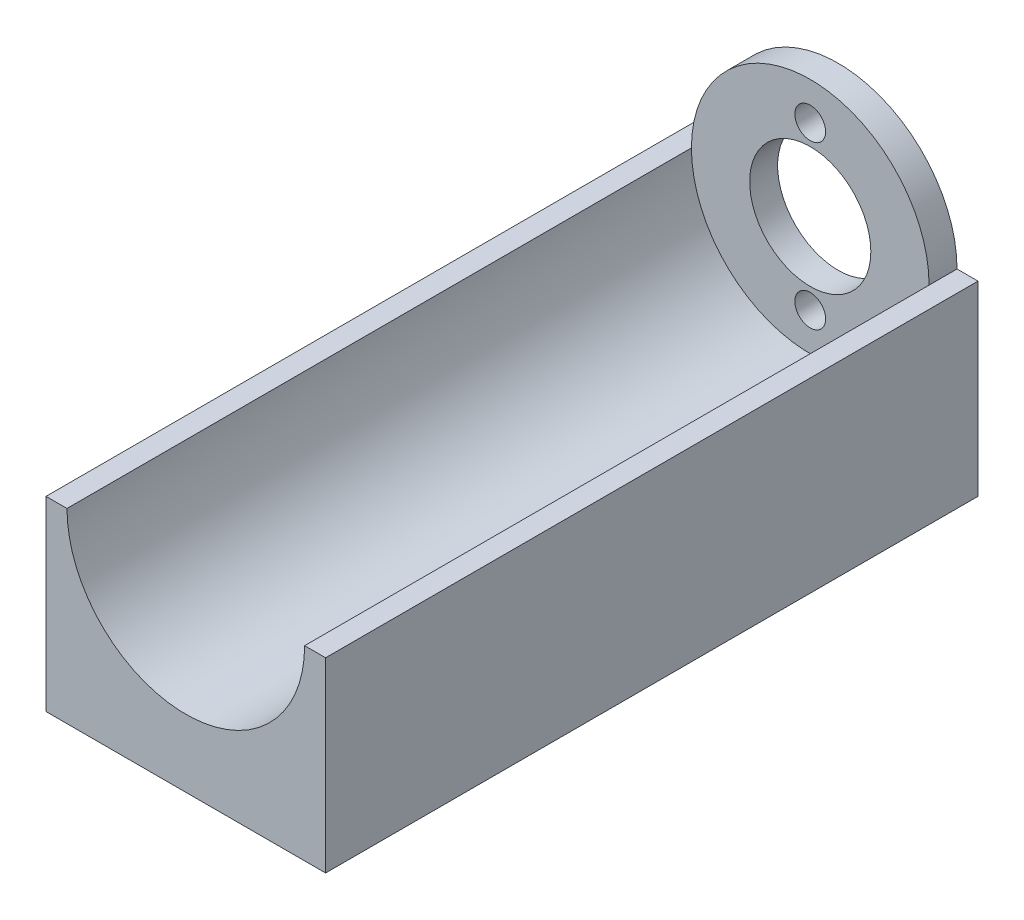
ISO-10303-21;
HEADER;
FILE_DESCRIPTION(('STEP AP214'),'2;1');
FILE_NAME('part.step','',(''),(''),'','','');
FILE_SCHEMA(('AUTOMOTIVE_DESIGN { 1 0 10303 214 1 1 1 1 }'));
ENDSEC;
DATA;
#1=APPLICATION_CONTEXT('core data for automotive mechanical design processes');
#2=APPLICATION_PROTOCOL_DEFINITION('international standard','automotive_design',2000,#1);
#3=PRODUCT_CONTEXT('',#1,'mechanical');
#4=PRODUCT('Part','Part','',(#3));
#5=PRODUCT_RELATED_PRODUCT_CATEGORY('part','',(#4));
#6=PRODUCT_DEFINITION_FORMATION('','',#4);
#7=PRODUCT_DEFINITION_CONTEXT('part definition',#1,'design');
#8=PRODUCT_DEFINITION('design','',#6,#7);
#9=PRODUCT_DEFINITION_SHAPE('','',#8);
#10=(LENGTH_UNIT() NAMED_UNIT(*) SI_UNIT(.MILLI.,.METRE.));
#11=(NAMED_UNIT(*) PLANE_ANGLE_UNIT() SI_UNIT($,.RADIAN.));
#12=(NAMED_UNIT(*) SI_UNIT($,.STERADIAN.) SOLID_ANGLE_UNIT());
#13=UNCERTAINTY_MEASURE_WITH_UNIT(LENGTH_MEASURE(1.E-05),#10,'distance_accuracy_value','');
#14=(GEOMETRIC_REPRESENTATION_CONTEXT(3) GLOBAL_UNCERTAINTY_ASSIGNED_CONTEXT((#13)) GLOBAL_UNIT_ASSIGNED_CONTEXT((#10,
#11,#12)) REPRESENTATION_CONTEXT('',''));
#15=CARTESIAN_POINT('',(0.,0.,0.));
#16=DIRECTION('',(0.,0.,1.));
#17=DIRECTION('',(1.,0.,0.));
#18=AXIS2_PLACEMENT_3D('',#15,#16,#17);
#19=CARTESIAN_POINT('',(0.,0.,3.));
#20=DIRECTION('',(0.,0.,-1.));
#21=DIRECTION('',(-1.,0.,0.));
#22=AXIS2_PLACEMENT_3D('',#19,#20,#21);
#23=CYLINDRICAL_SURFACE('',#22,12.75);
#24=DIRECTION('',(0.,0.,1.));
#25=VECTOR('',#24,1.);
#26=CARTESIAN_POINT('',(-12.75,0.,-36.0555127546399));
#27=LINE('',#26,#25);
#28=CARTESIAN_POINT('',(-12.75,0.,0.));
#29=VERTEX_POINT('',#28);
#30=CARTESIAN_POINT('',(-12.75,0.,3.));
#31=VERTEX_POINT('',#30);
#32=EDGE_CURVE('E62',#29,#31,#27,.T.);
#33=ORIENTED_EDGE('',*,*,#32,.T.);
#34=CARTESIAN_POINT('',(0.,0.,3.));
#35=DIRECTION('',(0.,0.,1.));
#36=DIRECTION('',(1.,0.,0.));
#37=AXIS2_PLACEMENT_3D('',#34,#35,#36);
#38=CIRCLE('',#37,12.75);
#39=CARTESIAN_POINT('',(12.75,0.,3.));
#40=VERTEX_POINT('',#39);
#41=EDGE_CURVE('E11',#40,#31,#38,.T.);
#42=ORIENTED_EDGE('',*,*,#41,.F.);
#43=DIRECTION('',(0.,0.,1.));
#44=VECTOR('',#43,1.);
#45=CARTESIAN_POINT('',(12.75,0.,-36.0555127546399));
#46=LINE('',#45,#44);
#47=CARTESIAN_POINT('',(12.75,0.,0.));
#48=VERTEX_POINT('',#47);
#49=EDGE_CURVE('E161',#48,#40,#46,.T.);
#50=ORIENTED_EDGE('',*,*,#49,.F.);
#51=CARTESIAN_POINT('',(0.,0.,0.));
#52=DIRECTION('',(0.,0.,1.));
#53=DIRECTION('',(1.,0.,0.));
#54=AXIS2_PLACEMENT_3D('',#51,#52,#53);
#55=CIRCLE('',#54,12.75);
#56=EDGE_CURVE('E46',#48,#29,#55,.T.);
#57=ORIENTED_EDGE('',*,*,#56,.T.);
#58=EDGE_LOOP('',(#33,#42,#50,#57));
#59=FACE_BOUND('',#58,.T.);
#60=ADVANCED_FACE('F43',(#59),#23,.T.);
#61=CARTESIAN_POINT('',(0.,0.,3.));
#62=DIRECTION('',(0.,0.,1.));
#63=DIRECTION('',(1.,0.,0.));
#64=AXIS2_PLACEMENT_3D('',#61,#62,#63);
#65=PLANE('',#64);
#66=CARTESIAN_POINT('',(0.,8.7,3.));
#67=DIRECTION('',(0.,0.,1.));
#68=DIRECTION('',(1.,0.,0.));
#69=AXIS2_PLACEMENT_3D('',#66,#67,#68);
#70=CIRCLE('',#69,1.65);
#71=CARTESIAN_POINT('',(1.65,8.7,3.));
#72=VERTEX_POINT('',#71);
#73=EDGE_CURVE('E196',#72,#72,#70,.T.);
#74=ORIENTED_EDGE('',*,*,#73,.F.);
#75=EDGE_LOOP('',(#74));
#76=FACE_BOUND('',#75,.T.);
#77=CARTESIAN_POINT('',(0.,-8.7,3.));
#78=DIRECTION('',(0.,0.,1.));
#79=DIRECTION('',(1.,0.,0.));
#80=AXIS2_PLACEMENT_3D('',#77,#78,#79);
#81=CIRCLE('',#80,1.65);
#82=CARTESIAN_POINT('',(1.65,-8.7,3.));
#83=VERTEX_POINT('',#82);
#84=EDGE_CURVE('E200',#83,#83,#81,.T.);
#85=ORIENTED_EDGE('',*,*,#84,.F.);
#86=EDGE_LOOP('',(#85));
#87=FACE_BOUND('',#86,.T.);
#88=ORIENTED_EDGE('',*,*,#41,.T.);
#89=EDGE_CURVE('E51',#31,#40,#38,.T.);
#90=ORIENTED_EDGE('',*,*,#89,.T.);
#91=EDGE_LOOP('',(#88,#90));
#92=FACE_BOUND('',#91,.T.);
#93=CARTESIAN_POINT('',(0.,0.,3.));
#94=DIRECTION('',(0.,0.,1.));
#95=DIRECTION('',(1.,0.,0.));
#96=AXIS2_PLACEMENT_3D('',#93,#94,#95);
#97=CIRCLE('',#96,6.5);
#98=CARTESIAN_POINT('',(6.5,0.,3.));
#99=VERTEX_POINT('',#98);
#100=EDGE_CURVE('E165',#99,#99,#97,.T.);
#101=ORIENTED_EDGE('',*,*,#100,.F.);
#102=EDGE_LOOP('',(#101));
#103=FACE_BOUND('',#102,.T.);
#104=ADVANCED_FACE('F183',(#76,#87,#92,#103),#65,.T.);
#105=CARTESIAN_POINT('',(0.,0.,0.));
#106=DIRECTION('',(0.,0.,1.));
#107=DIRECTION('',(1.,0.,0.));
#108=AXIS2_PLACEMENT_3D('',#105,#106,#107);
#109=PLANE('',#108);
#110=CARTESIAN_POINT('',(0.,8.7,0.));
#111=DIRECTION('',(0.,0.,-1.));
#112=DIRECTION('',(-1.,0.,0.));
#113=AXIS2_PLACEMENT_3D('',#110,#111,#112);
#114=CIRCLE('',#113,1.65);
#115=CARTESIAN_POINT('',(-1.65,8.7,0.));
#116=VERTEX_POINT('',#115);
#117=EDGE_CURVE('E366',#116,#116,#114,.T.);
#118=ORIENTED_EDGE('',*,*,#117,.F.);
#119=EDGE_LOOP('',(#118));
#120=FACE_BOUND('',#119,.T.);
#121=CARTESIAN_POINT('',(0.,-8.7,0.));
#122=DIRECTION('',(0.,0.,-1.));
#123=DIRECTION('',(1.,0.,0.));
#124=AXIS2_PLACEMENT_3D('',#121,#122,#123);
#125=CIRCLE('',#124,1.65);
#126=CARTESIAN_POINT('',(1.65,-8.7,0.));
#127=VERTEX_POINT('',#126);
#128=EDGE_CURVE('E367',#127,#127,#125,.T.);
#129=ORIENTED_EDGE('',*,*,#128,.F.);
#130=EDGE_LOOP('',(#129));
#131=FACE_BOUND('',#130,.T.);
#132=ORIENTED_EDGE('',*,*,#56,.F.);
#133=DIRECTION('',(1.,0.,0.));
#134=VECTOR('',#133,1.);
#135=CARTESIAN_POINT('',(0.,0.,0.));
#136=LINE('',#135,#134);
#137=CARTESIAN_POINT('',(15.,0.,0.));
#138=VERTEX_POINT('',#137);
#139=EDGE_CURVE('E153',#48,#138,#136,.T.);
#140=ORIENTED_EDGE('',*,*,#139,.T.);
#141=DIRECTION('',(0.,1.,0.));
#142=VECTOR('',#141,1.);
#143=CARTESIAN_POINT('',(15.,0.,0.));
#144=LINE('',#143,#142);
#145=CARTESIAN_POINT('',(15.,-20.,0.));
#146=VERTEX_POINT('',#145);
#147=EDGE_CURVE('E108',#146,#138,#144,.T.);
#148=ORIENTED_EDGE('',*,*,#147,.F.);
#149=DIRECTION('',(1.,0.,0.));
#150=VECTOR('',#149,1.);
#151=CARTESIAN_POINT('',(0.,-20.,0.));
#152=LINE('',#151,#150);
#153=CARTESIAN_POINT('',(-15.,-20.,0.));
#154=VERTEX_POINT('',#153);
#155=EDGE_CURVE('E149',#154,#146,#152,.T.);
#156=ORIENTED_EDGE('',*,*,#155,.F.);
#157=DIRECTION('',(0.,-1.,0.));
#158=VECTOR('',#157,1.);
#159=CARTESIAN_POINT('',(-15.,0.,0.));
#160=LINE('',#159,#158);
#161=CARTESIAN_POINT('',(-15.,0.,0.));
#162=VERTEX_POINT('',#161);
#163=EDGE_CURVE('E145',#162,#154,#160,.T.);
#164=ORIENTED_EDGE('',*,*,#163,.F.);
#165=DIRECTION('',(-1.,0.,0.));
#166=VECTOR('',#165,1.);
#167=CARTESIAN_POINT('',(0.,0.,0.));
#168=LINE('',#167,#166);
#169=EDGE_CURVE('E142',#29,#162,#168,.T.);
#170=ORIENTED_EDGE('',*,*,#169,.F.);
#171=EDGE_LOOP('',(#132,#140,#148,#156,#164,#170));
#172=FACE_BOUND('',#171,.T.);
#173=CARTESIAN_POINT('',(0.,0.,0.));
#174=DIRECTION('',(0.,0.,1.));
#175=DIRECTION('',(1.,0.,0.));
#176=AXIS2_PLACEMENT_3D('',#173,#174,#175);
#177=CIRCLE('',#176,6.5);
#178=CARTESIAN_POINT('',(6.5,0.,0.));
#179=VERTEX_POINT('',#178);
#180=EDGE_CURVE('E164',#179,#179,#177,.T.);
#181=ORIENTED_EDGE('',*,*,#180,.T.);
#182=EDGE_LOOP('',(#181));
#183=FACE_BOUND('',#182,.T.);
#184=ADVANCED_FACE('F171',(#120,#131,#172,#183),#109,.F.);
#185=CARTESIAN_POINT('',(0.,0.,3.));
#186=DIRECTION('',(0.,0.,-1.));
#187=DIRECTION('',(-1.,0.,0.));
#188=AXIS2_PLACEMENT_3D('',#185,#186,#187);
#189=CYLINDRICAL_SURFACE('',#188,6.5);
#190=ORIENTED_EDGE('',*,*,#100,.T.);
#191=EDGE_LOOP('',(#190));
#192=FACE_BOUND('',#191,.T.);
#193=ORIENTED_EDGE('',*,*,#180,.F.);
#194=EDGE_LOOP('',(#193));
#195=FACE_BOUND('',#194,.T.);
#196=ADVANCED_FACE('F173',(#192,#195),#189,.F.);
#197=CARTESIAN_POINT('',(15.,0.,-36.0555127546399));
#198=DIRECTION('',(-1.,0.,0.));
#199=DIRECTION('',(0.,0.,1.));
#200=AXIS2_PLACEMENT_3D('',#197,#198,#199);
#201=PLANE('',#200);
#202=DIRECTION('',(0.,0.,1.));
#203=VECTOR('',#202,1.);
#204=CARTESIAN_POINT('',(15.,-20.,-36.0555127546399));
#205=LINE('',#204,#203);
#206=CARTESIAN_POINT('',(15.,-20.,70.));
#207=VERTEX_POINT('',#206);
#208=EDGE_CURVE('E146',#146,#207,#205,.T.);
#209=ORIENTED_EDGE('',*,*,#208,.F.);
#210=ORIENTED_EDGE('',*,*,#147,.T.);
#211=DIRECTION('',(0.,0.,1.));
#212=VECTOR('',#211,1.);
#213=CARTESIAN_POINT('',(15.,0.,-36.0555127546399));
#214=LINE('',#213,#212);
#215=CARTESIAN_POINT('',(15.,0.,70.));
#216=VERTEX_POINT('',#215);
#217=EDGE_CURVE('E101',#138,#216,#214,.T.);
#218=ORIENTED_EDGE('',*,*,#217,.T.);
#219=DIRECTION('',(0.,-1.,0.));
#220=VECTOR('',#219,1.);
#221=CARTESIAN_POINT('',(15.,0.,70.));
#222=LINE('',#221,#220);
#223=EDGE_CURVE('E106',#216,#207,#222,.T.);
#224=ORIENTED_EDGE('',*,*,#223,.T.);
#225=EDGE_LOOP('',(#209,#210,#218,#224));
#226=FACE_BOUND('',#225,.T.);
#227=ADVANCED_FACE('F104',(#226),#201,.F.);
#228=CARTESIAN_POINT('',(0.,-20.,-36.0555127546399));
#229=DIRECTION('',(0.,1.,0.));
#230=DIRECTION('',(-1.,0.,0.));
#231=AXIS2_PLACEMENT_3D('',#228,#229,#230);
#232=PLANE('',#231);
#233=CARTESIAN_POINT('',(10.,-20.,7.00000000000001));
#234=DIRECTION('',(0.,-1.,0.));
#235=DIRECTION('',(1.,0.,0.));
#236=AXIS2_PLACEMENT_3D('',#233,#234,#235);
#237=CIRCLE('',#236,2.515);
#238=CARTESIAN_POINT('',(12.515,-20.,7.00000000000001));
#239=VERTEX_POINT('',#238);
#240=EDGE_CURVE('E374',#239,#239,#237,.T.);
#241=ORIENTED_EDGE('',*,*,#240,.F.);
#242=EDGE_LOOP('',(#241));
#243=FACE_BOUND('',#242,.T.);
#244=CARTESIAN_POINT('',(-10.,-20.,7.00000000000001));
#245=DIRECTION('',(0.,-1.,0.));
#246=DIRECTION('',(1.,0.,0.));
#247=AXIS2_PLACEMENT_3D('',#244,#245,#246);
#248=CIRCLE('',#247,2.515);
#249=CARTESIAN_POINT('',(-7.485,-20.,7.00000000000001));
#250=VERTEX_POINT('',#249);
#251=EDGE_CURVE('E380',#250,#250,#248,.T.);
#252=ORIENTED_EDGE('',*,*,#251,.F.);
#253=EDGE_LOOP('',(#252));
#254=FACE_BOUND('',#253,.T.);
#255=CARTESIAN_POINT('',(10.,-20.,17.));
#256=DIRECTION('',(0.,-1.,0.));
#257=DIRECTION('',(1.,0.,0.));
#258=AXIS2_PLACEMENT_3D('',#255,#256,#257);
#259=CIRCLE('',#258,2.515);
#260=CARTESIAN_POINT('',(12.515,-20.,17.));
#261=VERTEX_POINT('',#260);
#262=EDGE_CURVE('E386',#261,#261,#259,.T.);
#263=ORIENTED_EDGE('',*,*,#262,.F.);
#264=EDGE_LOOP('',(#263));
#265=FACE_BOUND('',#264,.T.);
#266=CARTESIAN_POINT('',(-10.,-20.,17.));
#267=DIRECTION('',(0.,-1.,0.));
#268=DIRECTION('',(1.,0.,0.));
#269=AXIS2_PLACEMENT_3D('',#266,#267,#268);
#270=CIRCLE('',#269,2.515);
#271=CARTESIAN_POINT('',(-7.485,-20.,17.));
#272=VERTEX_POINT('',#271);
#273=EDGE_CURVE('E392',#272,#272,#270,.T.);
#274=ORIENTED_EDGE('',*,*,#273,.F.);
#275=EDGE_LOOP('',(#274));
#276=FACE_BOUND('',#275,.T.);
#277=CARTESIAN_POINT('',(10.,-20.,27.));
#278=DIRECTION('',(0.,-1.,0.));
#279=DIRECTION('',(1.,0.,0.));
#280=AXIS2_PLACEMENT_3D('',#277,#278,#279);
#281=CIRCLE('',#280,2.515);
#282=CARTESIAN_POINT('',(12.515,-20.,27.));
#283=VERTEX_POINT('',#282);
#284=EDGE_CURVE('E398',#283,#283,#281,.T.);
#285=ORIENTED_EDGE('',*,*,#284,.F.);
#286=EDGE_LOOP('',(#285));
#287=FACE_BOUND('',#286,.T.);
#288=CARTESIAN_POINT('',(-10.,-20.,27.));
#289=DIRECTION('',(0.,-1.,0.));
#290=DIRECTION('',(1.,0.,0.));
#291=AXIS2_PLACEMENT_3D('',#288,#289,#290);
#292=CIRCLE('',#291,2.515);
#293=CARTESIAN_POINT('',(-7.485,-20.,27.));
#294=VERTEX_POINT('',#293);
#295=EDGE_CURVE('E404',#294,#294,#292,.T.);
#296=ORIENTED_EDGE('',*,*,#295,.F.);
#297=EDGE_LOOP('',(#296));
#298=FACE_BOUND('',#297,.T.);
#299=CARTESIAN_POINT('',(10.,-20.,37.));
#300=DIRECTION('',(0.,-1.,0.));
#301=DIRECTION('',(1.,0.,0.));
#302=AXIS2_PLACEMENT_3D('',#299,#300,#301);
#303=CIRCLE('',#302,2.515);
#304=CARTESIAN_POINT('',(12.515,-20.,37.));
#305=VERTEX_POINT('',#304);
#306=EDGE_CURVE('E410',#305,#305,#303,.T.);
#307=ORIENTED_EDGE('',*,*,#306,.F.);
#308=EDGE_LOOP('',(#307));
#309=FACE_BOUND('',#308,.T.);
#310=CARTESIAN_POINT('',(-10.,-20.,37.));
#311=DIRECTION('',(0.,-1.,0.));
#312=DIRECTION('',(1.,0.,0.));
#313=AXIS2_PLACEMENT_3D('',#310,#311,#312);
#314=CIRCLE('',#313,2.515);
#315=CARTESIAN_POINT('',(-7.485,-20.,37.));
#316=VERTEX_POINT('',#315);
#317=EDGE_CURVE('E416',#316,#316,#314,.T.);
#318=ORIENTED_EDGE('',*,*,#317,.F.);
#319=EDGE_LOOP('',(#318));
#320=FACE_BOUND('',#319,.T.);
#321=CARTESIAN_POINT('',(10.,-20.,47.));
#322=DIRECTION('',(0.,-1.,0.));
#323=DIRECTION('',(1.,0.,0.));
#324=AXIS2_PLACEMENT_3D('',#321,#322,#323);
#325=CIRCLE('',#324,2.515);
#326=CARTESIAN_POINT('',(12.515,-20.,47.));
#327=VERTEX_POINT('',#326);
#328=EDGE_CURVE('E422',#327,#327,#325,.T.);
#329=ORIENTED_EDGE('',*,*,#328,.F.);
#330=EDGE_LOOP('',(#329));
#331=FACE_BOUND('',#330,.T.);
#332=CARTESIAN_POINT('',(-10.,-20.,47.));
#333=DIRECTION('',(0.,-1.,0.));
#334=DIRECTION('',(1.,0.,0.));
#335=AXIS2_PLACEMENT_3D('',#332,#333,#334);
#336=CIRCLE('',#335,2.515);
#337=CARTESIAN_POINT('',(-7.485,-20.,47.));
#338=VERTEX_POINT('',#337);
#339=EDGE_CURVE('E428',#338,#338,#336,.T.);
#340=ORIENTED_EDGE('',*,*,#339,.F.);
#341=EDGE_LOOP('',(#340));
#342=FACE_BOUND('',#341,.T.);
#343=CARTESIAN_POINT('',(10.,-20.,57.));
#344=DIRECTION('',(0.,-1.,0.));
#345=DIRECTION('',(1.,0.,0.));
#346=AXIS2_PLACEMENT_3D('',#343,#344,#345);
#347=CIRCLE('',#346,2.515);
#348=CARTESIAN_POINT('',(12.515,-20.,57.));
#349=VERTEX_POINT('',#348);
#350=EDGE_CURVE('E434',#349,#349,#347,.T.);
#351=ORIENTED_EDGE('',*,*,#350,.F.);
#352=EDGE_LOOP('',(#351));
#353=FACE_BOUND('',#352,.T.);
#354=CARTESIAN_POINT('',(-10.,-20.,57.));
#355=DIRECTION('',(0.,-1.,0.));
#356=DIRECTION('',(1.,0.,0.));
#357=AXIS2_PLACEMENT_3D('',#354,#355,#356);
#358=CIRCLE('',#357,2.515);
#359=CARTESIAN_POINT('',(-7.485,-20.,57.));
#360=VERTEX_POINT('',#359);
#361=EDGE_CURVE('E440',#360,#360,#358,.T.);
#362=ORIENTED_EDGE('',*,*,#361,.F.);
#363=EDGE_LOOP('',(#362));
#364=FACE_BOUND('',#363,.T.);
#365=CARTESIAN_POINT('',(10.,-20.,67.));
#366=DIRECTION('',(0.,-1.,0.));
#367=DIRECTION('',(1.,0.,0.));
#368=AXIS2_PLACEMENT_3D('',#365,#366,#367);
#369=CIRCLE('',#368,2.515);
#370=CARTESIAN_POINT('',(12.515,-20.,67.));
#371=VERTEX_POINT('',#370);
#372=EDGE_CURVE('E446',#371,#371,#369,.T.);
#373=ORIENTED_EDGE('',*,*,#372,.F.);
#374=EDGE_LOOP('',(#373));
#375=FACE_BOUND('',#374,.T.);
#376=CARTESIAN_POINT('',(-10.,-20.,67.));
#377=DIRECTION('',(0.,-1.,0.));
#378=DIRECTION('',(1.,0.,0.));
#379=AXIS2_PLACEMENT_3D('',#376,#377,#378);
#380=CIRCLE('',#379,2.515);
#381=CARTESIAN_POINT('',(-7.485,-20.,67.));
#382=VERTEX_POINT('',#381);
#383=EDGE_CURVE('E130',#382,#382,#380,.T.);
#384=ORIENTED_EDGE('',*,*,#383,.F.);
#385=EDGE_LOOP('',(#384));
#386=FACE_BOUND('',#385,.T.);
#387=DIRECTION('',(0.,0.,1.));
#388=VECTOR('',#387,1.);
#389=CARTESIAN_POINT('',(-15.,-20.,-36.0555127546399));
#390=LINE('',#389,#388);
#391=CARTESIAN_POINT('',(-15.,-20.,70.));
#392=VERTEX_POINT('',#391);
#393=EDGE_CURVE('E155',#154,#392,#390,.T.);
#394=ORIENTED_EDGE('',*,*,#393,.F.);
#395=ORIENTED_EDGE('',*,*,#155,.T.);
#396=ORIENTED_EDGE('',*,*,#208,.T.);
#397=DIRECTION('',(-1.,0.,0.));
#398=VECTOR('',#397,1.);
#399=CARTESIAN_POINT('',(0.,-20.,70.));
#400=LINE('',#399,#398);
#401=EDGE_CURVE('E112',#207,#392,#400,.T.);
#402=ORIENTED_EDGE('',*,*,#401,.T.);
#403=EDGE_LOOP('',(#394,#395,#396,#402));
#404=FACE_BOUND('',#403,.T.);
#405=ADVANCED_FACE('F181',(#243,#254,#265,#276,#287,#298,#309,#320,#331,#342,#353,#364,#375,
#386,#404),#232,.F.);
#406=CARTESIAN_POINT('',(-15.,0.,-36.0555127546399));
#407=DIRECTION('',(1.,0.,0.));
#408=DIRECTION('',(0.,0.,-1.));
#409=AXIS2_PLACEMENT_3D('',#406,#407,#408);
#410=PLANE('',#409);
#411=DIRECTION('',(0.,0.,1.));
#412=VECTOR('',#411,1.);
#413=CARTESIAN_POINT('',(-15.,0.,-36.0555127546399));
#414=LINE('',#413,#412);
#415=CARTESIAN_POINT('',(-15.,0.,70.));
#416=VERTEX_POINT('',#415);
#417=EDGE_CURVE('E157',#162,#416,#414,.T.);
#418=ORIENTED_EDGE('',*,*,#417,.F.);
#419=ORIENTED_EDGE('',*,*,#163,.T.);
#420=ORIENTED_EDGE('',*,*,#393,.T.);
#421=DIRECTION('',(0.,1.,0.));
#422=VECTOR('',#421,1.);
#423=CARTESIAN_POINT('',(-15.,0.,70.));
#424=LINE('',#423,#422);
#425=EDGE_CURVE('E138',#392,#416,#424,.T.);
#426=ORIENTED_EDGE('',*,*,#425,.T.);
#427=EDGE_LOOP('',(#418,#419,#420,#426));
#428=FACE_BOUND('',#427,.T.);
#429=ADVANCED_FACE('F212',(#428),#410,.F.);
#430=CARTESIAN_POINT('',(0.,0.,-36.0555127546399));
#431=DIRECTION('',(0.,-1.,0.));
#432=DIRECTION('',(0.,0.,-1.));
#433=AXIS2_PLACEMENT_3D('',#430,#431,#432);
#434=PLANE('',#433);
#435=ORIENTED_EDGE('',*,*,#32,.F.);
#436=ORIENTED_EDGE('',*,*,#169,.T.);
#437=ORIENTED_EDGE('',*,*,#417,.T.);
#438=DIRECTION('',(1.,0.,0.));
#439=VECTOR('',#438,1.);
#440=CARTESIAN_POINT('',(0.,0.,70.));
#441=LINE('',#440,#439);
#442=CARTESIAN_POINT('',(-12.75,0.,70.));
#443=VERTEX_POINT('',#442);
#444=EDGE_CURVE('E135',#416,#443,#441,.T.);
#445=ORIENTED_EDGE('',*,*,#444,.T.);
#446=EDGE_CURVE('E160',#31,#443,#27,.T.);
#447=ORIENTED_EDGE('',*,*,#446,.F.);
#448=EDGE_LOOP('',(#435,#436,#437,#445,#447));
#449=FACE_BOUND('',#448,.T.);
#450=ADVANCED_FACE('F208',(#449),#434,.F.);
#451=CARTESIAN_POINT('',(0.,0.,-36.0555127546399));
#452=DIRECTION('',(0.,0.,1.));
#453=DIRECTION('',(1.,0.,0.));
#454=AXIS2_PLACEMENT_3D('',#451,#452,#453);
#455=CYLINDRICAL_SURFACE('',#454,12.75);
#456=ORIENTED_EDGE('',*,*,#89,.F.);
#457=ORIENTED_EDGE('',*,*,#446,.T.);
#458=CARTESIAN_POINT('',(0.,0.,70.));
#459=DIRECTION('',(0.,0.,1.));
#460=DIRECTION('',(1.,0.,0.));
#461=AXIS2_PLACEMENT_3D('',#458,#459,#460);
#462=CIRCLE('',#461,12.75);
#463=CARTESIAN_POINT('',(12.75,0.,70.));
#464=VERTEX_POINT('',#463);
#465=EDGE_CURVE('E122',#443,#464,#462,.T.);
#466=ORIENTED_EDGE('',*,*,#465,.T.);
#467=EDGE_CURVE('E111',#40,#464,#46,.T.);
#468=ORIENTED_EDGE('',*,*,#467,.F.);
#469=EDGE_LOOP('',(#456,#457,#466,#468));
#470=FACE_BOUND('',#469,.T.);
#471=ADVANCED_FACE('F206',(#470),#455,.F.);
#472=CARTESIAN_POINT('',(0.,0.,-36.0555127546399));
#473=DIRECTION('',(0.,1.,0.));
#474=DIRECTION('',(0.,0.,1.));
#475=AXIS2_PLACEMENT_3D('',#472,#473,#474);
#476=PLANE('',#475);
#477=ORIENTED_EDGE('',*,*,#139,.F.);
#478=ORIENTED_EDGE('',*,*,#49,.T.);
#479=ORIENTED_EDGE('',*,*,#467,.T.);
#480=DIRECTION('',(-1.,0.,0.));
#481=VECTOR('',#480,1.);
#482=CARTESIAN_POINT('',(0.,0.,70.));
#483=LINE('',#482,#481);
#484=EDGE_CURVE('E115',#216,#464,#483,.T.);
#485=ORIENTED_EDGE('',*,*,#484,.F.);
#486=ORIENTED_EDGE('',*,*,#217,.F.);
#487=EDGE_LOOP('',(#477,#478,#479,#485,#486));
#488=FACE_BOUND('',#487,.T.);
#489=ADVANCED_FACE('F116',(#488),#476,.T.);
#490=CARTESIAN_POINT('',(0.,0.,70.));
#491=DIRECTION('',(0.,0.,1.));
#492=DIRECTION('',(1.,0.,0.));
#493=AXIS2_PLACEMENT_3D('',#490,#491,#492);
#494=PLANE('',#493);
#495=ORIENTED_EDGE('',*,*,#223,.F.);
#496=ORIENTED_EDGE('',*,*,#484,.T.);
#497=ORIENTED_EDGE('',*,*,#465,.F.);
#498=ORIENTED_EDGE('',*,*,#444,.F.);
#499=ORIENTED_EDGE('',*,*,#425,.F.);
#500=ORIENTED_EDGE('',*,*,#401,.F.);
#501=EDGE_LOOP('',(#495,#496,#497,#498,#499,#500));
#502=FACE_BOUND('',#501,.T.);
#503=ADVANCED_FACE('F124',(#502),#494,.T.);
#504=CARTESIAN_POINT('',(-10.,-14.,67.));
#505=DIRECTION('',(0.,-1.,0.));
#506=DIRECTION('',(1.,0.,0.));
#507=AXIS2_PLACEMENT_3D('',#504,#505,#506);
#508=CYLINDRICAL_SURFACE('',#507,2.515);
#509=CARTESIAN_POINT('',(-10.,-14.,67.));
#510=DIRECTION('',(0.,-1.,0.));
#511=DIRECTION('',(1.,0.,0.));
#512=AXIS2_PLACEMENT_3D('',#509,#510,#511);
#513=CIRCLE('',#512,2.515);
#514=CARTESIAN_POINT('',(-7.485,-14.,67.));
#515=VERTEX_POINT('',#514);
#516=EDGE_CURVE('E127',#515,#515,#513,.T.);
#517=ORIENTED_EDGE('',*,*,#516,.F.);
#518=EDGE_LOOP('',(#517));
#519=FACE_BOUND('',#518,.T.);
#520=ORIENTED_EDGE('',*,*,#383,.T.);
#521=EDGE_LOOP('',(#520));
#522=FACE_BOUND('',#521,.T.);
#523=ADVANCED_FACE('F236',(#519,#522),#508,.F.);
#524=CARTESIAN_POINT('',(-10.,-14.,67.));
#525=DIRECTION('',(0.,-1.,0.));
#526=DIRECTION('',(1.,0.,0.));
#527=AXIS2_PLACEMENT_3D('',#524,#525,#526);
#528=PLANE('',#527);
#529=ORIENTED_EDGE('',*,*,#516,.T.);
#530=EDGE_LOOP('',(#529));
#531=FACE_BOUND('',#530,.T.);
#532=ADVANCED_FACE('F240',(#531),#528,.T.);
#533=CARTESIAN_POINT('',(10.,-14.,67.));
#534=DIRECTION('',(0.,-1.,0.));
#535=DIRECTION('',(1.,0.,0.));
#536=AXIS2_PLACEMENT_3D('',#533,#534,#535);
#537=CYLINDRICAL_SURFACE('',#536,2.515);
#538=CARTESIAN_POINT('',(10.,-14.,67.));
#539=DIRECTION('',(0.,-1.,0.));
#540=DIRECTION('',(1.,0.,0.));
#541=AXIS2_PLACEMENT_3D('',#538,#539,#540);
#542=CIRCLE('',#541,2.515);
#543=CARTESIAN_POINT('',(12.515,-14.,67.));
#544=VERTEX_POINT('',#543);
#545=EDGE_CURVE('E449',#544,#544,#542,.T.);
#546=ORIENTED_EDGE('',*,*,#545,.F.);
#547=EDGE_LOOP('',(#546));
#548=FACE_BOUND('',#547,.T.);
#549=ORIENTED_EDGE('',*,*,#372,.T.);
#550=EDGE_LOOP('',(#549));
#551=FACE_BOUND('',#550,.T.);
#552=ADVANCED_FACE('F245',(#548,#551),#537,.F.);
#553=CARTESIAN_POINT('',(10.,-14.,67.));
#554=DIRECTION('',(0.,-1.,0.));
#555=DIRECTION('',(1.,0.,0.));
#556=AXIS2_PLACEMENT_3D('',#553,#554,#555);
#557=PLANE('',#556);
#558=ORIENTED_EDGE('',*,*,#545,.T.);
#559=EDGE_LOOP('',(#558));
#560=FACE_BOUND('',#559,.T.);
#561=ADVANCED_FACE('F253',(#560),#557,.T.);
#562=CARTESIAN_POINT('',(-10.,-14.,57.));
#563=DIRECTION('',(0.,-1.,0.));
#564=DIRECTION('',(1.,0.,0.));
#565=AXIS2_PLACEMENT_3D('',#562,#563,#564);
#566=CYLINDRICAL_SURFACE('',#565,2.515);
#567=CARTESIAN_POINT('',(-10.,-14.,57.));
#568=DIRECTION('',(0.,-1.,0.));
#569=DIRECTION('',(1.,0.,0.));
#570=AXIS2_PLACEMENT_3D('',#567,#568,#569);
#571=CIRCLE('',#570,2.515);
#572=CARTESIAN_POINT('',(-7.485,-14.,57.));
#573=VERTEX_POINT('',#572);
#574=EDGE_CURVE('E443',#573,#573,#571,.T.);
#575=ORIENTED_EDGE('',*,*,#574,.F.);
#576=EDGE_LOOP('',(#575));
#577=FACE_BOUND('',#576,.T.);
#578=ORIENTED_EDGE('',*,*,#361,.T.);
#579=EDGE_LOOP('',(#578));
#580=FACE_BOUND('',#579,.T.);
#581=ADVANCED_FACE('F257',(#577,#580),#566,.F.);
#582=CARTESIAN_POINT('',(-10.,-14.,57.));
#583=DIRECTION('',(0.,-1.,0.));
#584=DIRECTION('',(1.,0.,0.));
#585=AXIS2_PLACEMENT_3D('',#582,#583,#584);
#586=PLANE('',#585);
#587=ORIENTED_EDGE('',*,*,#574,.T.);
#588=EDGE_LOOP('',(#587));
#589=FACE_BOUND('',#588,.T.);
#590=ADVANCED_FACE('F261',(#589),#586,.T.);
#591=CARTESIAN_POINT('',(10.,-14.,57.));
#592=DIRECTION('',(0.,-1.,0.));
#593=DIRECTION('',(1.,0.,0.));
#594=AXIS2_PLACEMENT_3D('',#591,#592,#593);
#595=CYLINDRICAL_SURFACE('',#594,2.515);
#596=CARTESIAN_POINT('',(10.,-14.,57.));
#597=DIRECTION('',(0.,-1.,0.));
#598=DIRECTION('',(1.,0.,0.));
#599=AXIS2_PLACEMENT_3D('',#596,#597,#598);
#600=CIRCLE('',#599,2.515);
#601=CARTESIAN_POINT('',(12.515,-14.,57.));
#602=VERTEX_POINT('',#601);
#603=EDGE_CURVE('E437',#602,#602,#600,.T.);
#604=ORIENTED_EDGE('',*,*,#603,.F.);
#605=EDGE_LOOP('',(#604));
#606=FACE_BOUND('',#605,.T.);
#607=ORIENTED_EDGE('',*,*,#350,.T.);
#608=EDGE_LOOP('',(#607));
#609=FACE_BOUND('',#608,.T.);
#610=ADVANCED_FACE('F265',(#606,#609),#595,.F.);
#611=CARTESIAN_POINT('',(10.,-14.,57.));
#612=DIRECTION('',(0.,-1.,0.));
#613=DIRECTION('',(1.,0.,0.));
#614=AXIS2_PLACEMENT_3D('',#611,#612,#613);
#615=PLANE('',#614);
#616=ORIENTED_EDGE('',*,*,#603,.T.);
#617=EDGE_LOOP('',(#616));
#618=FACE_BOUND('',#617,.T.);
#619=ADVANCED_FACE('F269',(#618),#615,.T.);
#620=CARTESIAN_POINT('',(-10.,-14.,47.));
#621=DIRECTION('',(0.,-1.,0.));
#622=DIRECTION('',(1.,0.,0.));
#623=AXIS2_PLACEMENT_3D('',#620,#621,#622);
#624=CYLINDRICAL_SURFACE('',#623,2.515);
#625=CARTESIAN_POINT('',(-10.,-14.,47.));
#626=DIRECTION('',(0.,-1.,0.));
#627=DIRECTION('',(1.,0.,0.));
#628=AXIS2_PLACEMENT_3D('',#625,#626,#627);
#629=CIRCLE('',#628,2.515);
#630=CARTESIAN_POINT('',(-7.485,-14.,47.));
#631=VERTEX_POINT('',#630);
#632=EDGE_CURVE('E431',#631,#631,#629,.T.);
#633=ORIENTED_EDGE('',*,*,#632,.F.);
#634=EDGE_LOOP('',(#633));
#635=FACE_BOUND('',#634,.T.);
#636=ORIENTED_EDGE('',*,*,#339,.T.);
#637=EDGE_LOOP('',(#636));
#638=FACE_BOUND('',#637,.T.);
#639=ADVANCED_FACE('F273',(#635,#638),#624,.F.);
#640=CARTESIAN_POINT('',(-10.,-14.,47.));
#641=DIRECTION('',(0.,-1.,0.));
#642=DIRECTION('',(1.,0.,0.));
#643=AXIS2_PLACEMENT_3D('',#640,#641,#642);
#644=PLANE('',#643);
#645=ORIENTED_EDGE('',*,*,#632,.T.);
#646=EDGE_LOOP('',(#645));
#647=FACE_BOUND('',#646,.T.);
#648=ADVANCED_FACE('F277',(#647),#644,.T.);
#649=CARTESIAN_POINT('',(10.,-14.,47.));
#650=DIRECTION('',(0.,-1.,0.));
#651=DIRECTION('',(1.,0.,0.));
#652=AXIS2_PLACEMENT_3D('',#649,#650,#651);
#653=CYLINDRICAL_SURFACE('',#652,2.515);
#654=CARTESIAN_POINT('',(10.,-14.,47.));
#655=DIRECTION('',(0.,-1.,0.));
#656=DIRECTION('',(1.,0.,0.));
#657=AXIS2_PLACEMENT_3D('',#654,#655,#656);
#658=CIRCLE('',#657,2.515);
#659=CARTESIAN_POINT('',(12.515,-14.,47.));
#660=VERTEX_POINT('',#659);
#661=EDGE_CURVE('E425',#660,#660,#658,.T.);
#662=ORIENTED_EDGE('',*,*,#661,.F.);
#663=EDGE_LOOP('',(#662));
#664=FACE_BOUND('',#663,.T.);
#665=ORIENTED_EDGE('',*,*,#328,.T.);
#666=EDGE_LOOP('',(#665));
#667=FACE_BOUND('',#666,.T.);
#668=ADVANCED_FACE('F281',(#664,#667),#653,.F.);
#669=CARTESIAN_POINT('',(10.,-14.,47.));
#670=DIRECTION('',(0.,-1.,0.));
#671=DIRECTION('',(1.,0.,0.));
#672=AXIS2_PLACEMENT_3D('',#669,#670,#671);
#673=PLANE('',#672);
#674=ORIENTED_EDGE('',*,*,#661,.T.);
#675=EDGE_LOOP('',(#674));
#676=FACE_BOUND('',#675,.T.);
#677=ADVANCED_FACE('F285',(#676),#673,.T.);
#678=CARTESIAN_POINT('',(-10.,-14.,37.));
#679=DIRECTION('',(0.,-1.,0.));
#680=DIRECTION('',(1.,0.,0.));
#681=AXIS2_PLACEMENT_3D('',#678,#679,#680);
#682=CYLINDRICAL_SURFACE('',#681,2.515);
#683=CARTESIAN_POINT('',(-10.,-14.,37.));
#684=DIRECTION('',(0.,-1.,0.));
#685=DIRECTION('',(1.,0.,0.));
#686=AXIS2_PLACEMENT_3D('',#683,#684,#685);
#687=CIRCLE('',#686,2.515);
#688=CARTESIAN_POINT('',(-7.485,-14.,37.));
#689=VERTEX_POINT('',#688);
#690=EDGE_CURVE('E419',#689,#689,#687,.T.);
#691=ORIENTED_EDGE('',*,*,#690,.F.);
#692=EDGE_LOOP('',(#691));
#693=FACE_BOUND('',#692,.T.);
#694=ORIENTED_EDGE('',*,*,#317,.T.);
#695=EDGE_LOOP('',(#694));
#696=FACE_BOUND('',#695,.T.);
#697=ADVANCED_FACE('F289',(#693,#696),#682,.F.);
#698=CARTESIAN_POINT('',(-10.,-14.,37.));
#699=DIRECTION('',(0.,-1.,0.));
#700=DIRECTION('',(1.,0.,0.));
#701=AXIS2_PLACEMENT_3D('',#698,#699,#700);
#702=PLANE('',#701);
#703=ORIENTED_EDGE('',*,*,#690,.T.);
#704=EDGE_LOOP('',(#703));
#705=FACE_BOUND('',#704,.T.);
#706=ADVANCED_FACE('F293',(#705),#702,.T.);
#707=CARTESIAN_POINT('',(10.,-14.,37.));
#708=DIRECTION('',(0.,-1.,0.));
#709=DIRECTION('',(1.,0.,0.));
#710=AXIS2_PLACEMENT_3D('',#707,#708,#709);
#711=CYLINDRICAL_SURFACE('',#710,2.515);
#712=CARTESIAN_POINT('',(10.,-14.,37.));
#713=DIRECTION('',(0.,-1.,0.));
#714=DIRECTION('',(1.,0.,0.));
#715=AXIS2_PLACEMENT_3D('',#712,#713,#714);
#716=CIRCLE('',#715,2.515);
#717=CARTESIAN_POINT('',(12.515,-14.,37.));
#718=VERTEX_POINT('',#717);
#719=EDGE_CURVE('E413',#718,#718,#716,.T.);
#720=ORIENTED_EDGE('',*,*,#719,.F.);
#721=EDGE_LOOP('',(#720));
#722=FACE_BOUND('',#721,.T.);
#723=ORIENTED_EDGE('',*,*,#306,.T.);
#724=EDGE_LOOP('',(#723));
#725=FACE_BOUND('',#724,.T.);
#726=ADVANCED_FACE('F297',(#722,#725),#711,.F.);
#727=CARTESIAN_POINT('',(10.,-14.,37.));
#728=DIRECTION('',(0.,-1.,0.));
#729=DIRECTION('',(1.,0.,0.));
#730=AXIS2_PLACEMENT_3D('',#727,#728,#729);
#731=PLANE('',#730);
#732=ORIENTED_EDGE('',*,*,#719,.T.);
#733=EDGE_LOOP('',(#732));
#734=FACE_BOUND('',#733,.T.);
#735=ADVANCED_FACE('F301',(#734),#731,.T.);
#736=CARTESIAN_POINT('',(-10.,-14.,27.));
#737=DIRECTION('',(0.,-1.,0.));
#738=DIRECTION('',(1.,0.,0.));
#739=AXIS2_PLACEMENT_3D('',#736,#737,#738);
#740=CYLINDRICAL_SURFACE('',#739,2.515);
#741=CARTESIAN_POINT('',(-10.,-14.,27.));
#742=DIRECTION('',(0.,-1.,0.));
#743=DIRECTION('',(1.,0.,0.));
#744=AXIS2_PLACEMENT_3D('',#741,#742,#743);
#745=CIRCLE('',#744,2.515);
#746=CARTESIAN_POINT('',(-7.485,-14.,27.));
#747=VERTEX_POINT('',#746);
#748=EDGE_CURVE('E407',#747,#747,#745,.T.);
#749=ORIENTED_EDGE('',*,*,#748,.F.);
#750=EDGE_LOOP('',(#749));
#751=FACE_BOUND('',#750,.T.);
#752=ORIENTED_EDGE('',*,*,#295,.T.);
#753=EDGE_LOOP('',(#752));
#754=FACE_BOUND('',#753,.T.);
#755=ADVANCED_FACE('F305',(#751,#754),#740,.F.);
#756=CARTESIAN_POINT('',(-10.,-14.,27.));
#757=DIRECTION('',(0.,-1.,0.));
#758=DIRECTION('',(1.,0.,0.));
#759=AXIS2_PLACEMENT_3D('',#756,#757,#758);
#760=PLANE('',#759);
#761=ORIENTED_EDGE('',*,*,#748,.T.);
#762=EDGE_LOOP('',(#761));
#763=FACE_BOUND('',#762,.T.);
#764=ADVANCED_FACE('F309',(#763),#760,.T.);
#765=CARTESIAN_POINT('',(10.,-14.,27.));
#766=DIRECTION('',(0.,-1.,0.));
#767=DIRECTION('',(1.,0.,0.));
#768=AXIS2_PLACEMENT_3D('',#765,#766,#767);
#769=CYLINDRICAL_SURFACE('',#768,2.515);
#770=CARTESIAN_POINT('',(10.,-14.,27.));
#771=DIRECTION('',(0.,-1.,0.));
#772=DIRECTION('',(1.,0.,0.));
#773=AXIS2_PLACEMENT_3D('',#770,#771,#772);
#774=CIRCLE('',#773,2.515);
#775=CARTESIAN_POINT('',(12.515,-14.,27.));
#776=VERTEX_POINT('',#775);
#777=EDGE_CURVE('E401',#776,#776,#774,.T.);
#778=ORIENTED_EDGE('',*,*,#777,.F.);
#779=EDGE_LOOP('',(#778));
#780=FACE_BOUND('',#779,.T.);
#781=ORIENTED_EDGE('',*,*,#284,.T.);
#782=EDGE_LOOP('',(#781));
#783=FACE_BOUND('',#782,.T.);
#784=ADVANCED_FACE('F313',(#780,#783),#769,.F.);
#785=CARTESIAN_POINT('',(10.,-14.,27.));
#786=DIRECTION('',(0.,-1.,0.));
#787=DIRECTION('',(1.,0.,0.));
#788=AXIS2_PLACEMENT_3D('',#785,#786,#787);
#789=PLANE('',#788);
#790=ORIENTED_EDGE('',*,*,#777,.T.);
#791=EDGE_LOOP('',(#790));
#792=FACE_BOUND('',#791,.T.);
#793=ADVANCED_FACE('F317',(#792),#789,.T.);
#794=CARTESIAN_POINT('',(-10.,-14.,17.));
#795=DIRECTION('',(0.,-1.,0.));
#796=DIRECTION('',(1.,0.,0.));
#797=AXIS2_PLACEMENT_3D('',#794,#795,#796);
#798=CYLINDRICAL_SURFACE('',#797,2.515);
#799=CARTESIAN_POINT('',(-10.,-14.,17.));
#800=DIRECTION('',(0.,-1.,0.));
#801=DIRECTION('',(1.,0.,0.));
#802=AXIS2_PLACEMENT_3D('',#799,#800,#801);
#803=CIRCLE('',#802,2.515);
#804=CARTESIAN_POINT('',(-7.485,-14.,17.));
#805=VERTEX_POINT('',#804);
#806=EDGE_CURVE('E395',#805,#805,#803,.T.);
#807=ORIENTED_EDGE('',*,*,#806,.F.);
#808=EDGE_LOOP('',(#807));
#809=FACE_BOUND('',#808,.T.);
#810=ORIENTED_EDGE('',*,*,#273,.T.);
#811=EDGE_LOOP('',(#810));
#812=FACE_BOUND('',#811,.T.);
#813=ADVANCED_FACE('F321',(#809,#812),#798,.F.);
#814=CARTESIAN_POINT('',(-10.,-14.,17.));
#815=DIRECTION('',(0.,-1.,0.));
#816=DIRECTION('',(1.,0.,0.));
#817=AXIS2_PLACEMENT_3D('',#814,#815,#816);
#818=PLANE('',#817);
#819=ORIENTED_EDGE('',*,*,#806,.T.);
#820=EDGE_LOOP('',(#819));
#821=FACE_BOUND('',#820,.T.);
#822=ADVANCED_FACE('F325',(#821),#818,.T.);
#823=CARTESIAN_POINT('',(10.,-14.,17.));
#824=DIRECTION('',(0.,-1.,0.));
#825=DIRECTION('',(1.,0.,0.));
#826=AXIS2_PLACEMENT_3D('',#823,#824,#825);
#827=CYLINDRICAL_SURFACE('',#826,2.515);
#828=CARTESIAN_POINT('',(10.,-14.,17.));
#829=DIRECTION('',(0.,-1.,0.));
#830=DIRECTION('',(1.,0.,0.));
#831=AXIS2_PLACEMENT_3D('',#828,#829,#830);
#832=CIRCLE('',#831,2.515);
#833=CARTESIAN_POINT('',(12.515,-14.,17.));
#834=VERTEX_POINT('',#833);
#835=EDGE_CURVE('E389',#834,#834,#832,.T.);
#836=ORIENTED_EDGE('',*,*,#835,.F.);
#837=EDGE_LOOP('',(#836));
#838=FACE_BOUND('',#837,.T.);
#839=ORIENTED_EDGE('',*,*,#262,.T.);
#840=EDGE_LOOP('',(#839));
#841=FACE_BOUND('',#840,.T.);
#842=ADVANCED_FACE('F329',(#838,#841),#827,.F.);
#843=CARTESIAN_POINT('',(10.,-14.,17.));
#844=DIRECTION('',(0.,-1.,0.));
#845=DIRECTION('',(1.,0.,0.));
#846=AXIS2_PLACEMENT_3D('',#843,#844,#845);
#847=PLANE('',#846);
#848=ORIENTED_EDGE('',*,*,#835,.T.);
#849=EDGE_LOOP('',(#848));
#850=FACE_BOUND('',#849,.T.);
#851=ADVANCED_FACE('F333',(#850),#847,.T.);
#852=CARTESIAN_POINT('',(-10.,-14.,7.00000000000001));
#853=DIRECTION('',(0.,-1.,0.));
#854=DIRECTION('',(1.,0.,0.));
#855=AXIS2_PLACEMENT_3D('',#852,#853,#854);
#856=CYLINDRICAL_SURFACE('',#855,2.515);
#857=CARTESIAN_POINT('',(-10.,-14.,7.00000000000001));
#858=DIRECTION('',(0.,-1.,0.));
#859=DIRECTION('',(1.,0.,0.));
#860=AXIS2_PLACEMENT_3D('',#857,#858,#859);
#861=CIRCLE('',#860,2.515);
#862=CARTESIAN_POINT('',(-7.485,-14.,7.00000000000001));
#863=VERTEX_POINT('',#862);
#864=EDGE_CURVE('E383',#863,#863,#861,.T.);
#865=ORIENTED_EDGE('',*,*,#864,.F.);
#866=EDGE_LOOP('',(#865));
#867=FACE_BOUND('',#866,.T.);
#868=ORIENTED_EDGE('',*,*,#251,.T.);
#869=EDGE_LOOP('',(#868));
#870=FACE_BOUND('',#869,.T.);
#871=ADVANCED_FACE('F337',(#867,#870),#856,.F.);
#872=CARTESIAN_POINT('',(-10.,-14.,7.00000000000001));
#873=DIRECTION('',(0.,-1.,0.));
#874=DIRECTION('',(1.,0.,0.));
#875=AXIS2_PLACEMENT_3D('',#872,#873,#874);
#876=PLANE('',#875);
#877=ORIENTED_EDGE('',*,*,#864,.T.);
#878=EDGE_LOOP('',(#877));
#879=FACE_BOUND('',#878,.T.);
#880=ADVANCED_FACE('F341',(#879),#876,.T.);
#881=CARTESIAN_POINT('',(10.,-14.,7.00000000000001));
#882=DIRECTION('',(0.,-1.,0.));
#883=DIRECTION('',(1.,0.,0.));
#884=AXIS2_PLACEMENT_3D('',#881,#882,#883);
#885=CYLINDRICAL_SURFACE('',#884,2.515);
#886=CARTESIAN_POINT('',(10.,-14.,7.00000000000001));
#887=DIRECTION('',(0.,-1.,0.));
#888=DIRECTION('',(1.,0.,0.));
#889=AXIS2_PLACEMENT_3D('',#886,#887,#888);
#890=CIRCLE('',#889,2.515);
#891=CARTESIAN_POINT('',(12.515,-14.,7.00000000000001));
#892=VERTEX_POINT('',#891);
#893=EDGE_CURVE('E377',#892,#892,#890,.T.);
#894=ORIENTED_EDGE('',*,*,#893,.F.);
#895=EDGE_LOOP('',(#894));
#896=FACE_BOUND('',#895,.T.);
#897=ORIENTED_EDGE('',*,*,#240,.T.);
#898=EDGE_LOOP('',(#897));
#899=FACE_BOUND('',#898,.T.);
#900=ADVANCED_FACE('F345',(#896,#899),#885,.F.);
#901=CARTESIAN_POINT('',(10.,-14.,7.00000000000001));
#902=DIRECTION('',(0.,-1.,0.));
#903=DIRECTION('',(1.,0.,0.));
#904=AXIS2_PLACEMENT_3D('',#901,#902,#903);
#905=PLANE('',#904);
#906=ORIENTED_EDGE('',*,*,#893,.T.);
#907=EDGE_LOOP('',(#906));
#908=FACE_BOUND('',#907,.T.);
#909=ADVANCED_FACE('F349',(#908),#905,.T.);
#910=CARTESIAN_POINT('',(0.,-8.7,75.));
#911=DIRECTION('',(0.,0.,-1.));
#912=DIRECTION('',(-1.,0.,0.));
#913=AXIS2_PLACEMENT_3D('',#910,#911,#912);
#914=CYLINDRICAL_SURFACE('',#913,1.65);
#915=ORIENTED_EDGE('',*,*,#84,.T.);
#916=EDGE_LOOP('',(#915));
#917=FACE_BOUND('',#916,.T.);
#918=ORIENTED_EDGE('',*,*,#128,.T.);
#919=EDGE_LOOP('',(#918));
#920=FACE_BOUND('',#919,.T.);
#921=ADVANCED_FACE('F353',(#917,#920),#914,.F.);
#922=CARTESIAN_POINT('',(0.,8.7,75.));
#923=DIRECTION('',(0.,0.,-1.));
#924=DIRECTION('',(-1.,0.,0.));
#925=AXIS2_PLACEMENT_3D('',#922,#923,#924);
#926=CYLINDRICAL_SURFACE('',#925,1.65);
#927=ORIENTED_EDGE('',*,*,#73,.T.);
#928=EDGE_LOOP('',(#927));
#929=FACE_BOUND('',#928,.T.);
#930=ORIENTED_EDGE('',*,*,#117,.T.);
#931=EDGE_LOOP('',(#930));
#932=FACE_BOUND('',#931,.T.);
#933=ADVANCED_FACE('F357',(#929,#932),#926,.F.);
#934=CLOSED_SHELL('',(#60,#104,#184,#196,#227,#405,#429,#450,#471,#489,#503,#523,#532,#552,#561,
#581,#590,#610,#619,#639,#648,#668,#677,#697,#706,#726,#735,#755,#764,#784,#793,#813,#822,#842,
#851,#871,#880,#900,#909,#921,#933));
#935=MANIFOLD_SOLID_BREP('B2',#934);
#936=ADVANCED_BREP_SHAPE_REPRESENTATION('',(#18,#935),#14);
#937=SHAPE_DEFINITION_REPRESENTATION(#9,#936);
ENDSEC;
END-ISO-10303-21;
